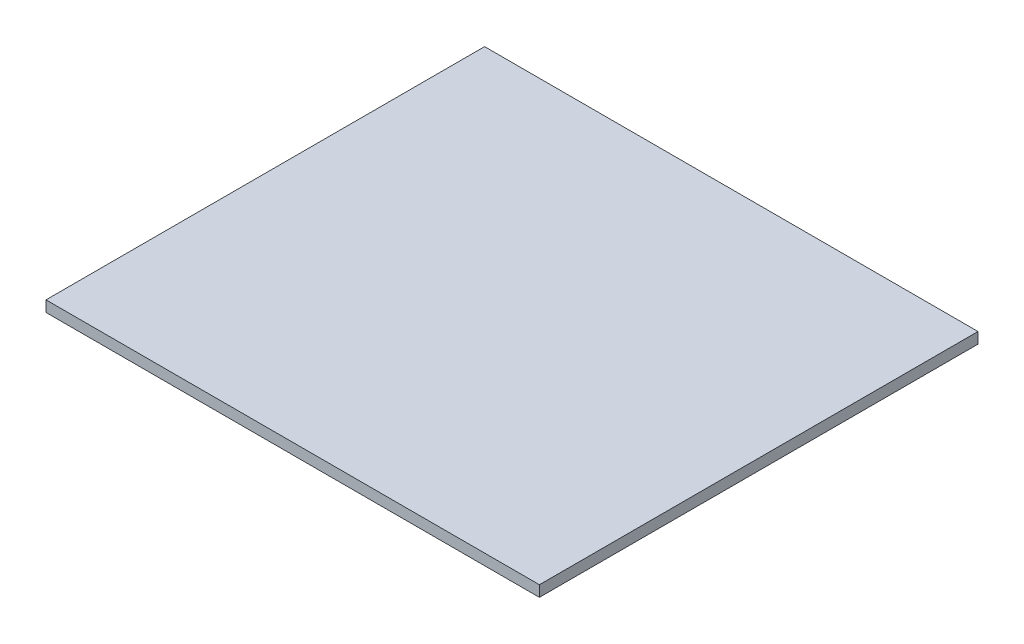
ISO-10303-21;
HEADER;
FILE_DESCRIPTION(('STEP AP214'),'2;1');
FILE_NAME('part.step','',(''),(''),'','','');
FILE_SCHEMA(('AUTOMOTIVE_DESIGN { 1 0 10303 214 1 1 1 1 }'));
ENDSEC;
DATA;
#1=APPLICATION_CONTEXT('core data for automotive mechanical design processes');
#2=APPLICATION_PROTOCOL_DEFINITION('international standard','automotive_design',2000,#1);
#3=PRODUCT_CONTEXT('',#1,'mechanical');
#4=PRODUCT('Part','Part','',(#3));
#5=PRODUCT_RELATED_PRODUCT_CATEGORY('part','',(#4));
#6=PRODUCT_DEFINITION_FORMATION('','',#4);
#7=PRODUCT_DEFINITION_CONTEXT('part definition',#1,'design');
#8=PRODUCT_DEFINITION('design','',#6,#7);
#9=PRODUCT_DEFINITION_SHAPE('','',#8);
#10=(LENGTH_UNIT() NAMED_UNIT(*) SI_UNIT(.MILLI.,.METRE.));
#11=(NAMED_UNIT(*) PLANE_ANGLE_UNIT() SI_UNIT($,.RADIAN.));
#12=(NAMED_UNIT(*) SI_UNIT($,.STERADIAN.) SOLID_ANGLE_UNIT());
#13=UNCERTAINTY_MEASURE_WITH_UNIT(LENGTH_MEASURE(1.E-05),#10,'distance_accuracy_value','');
#14=(GEOMETRIC_REPRESENTATION_CONTEXT(3) GLOBAL_UNCERTAINTY_ASSIGNED_CONTEXT((#13)) GLOBAL_UNIT_ASSIGNED_CONTEXT((#10,
#11,#12)) REPRESENTATION_CONTEXT('',''));
#15=CARTESIAN_POINT('',(0.,0.,0.));
#16=DIRECTION('',(0.,0.,1.));
#17=DIRECTION('',(1.,0.,0.));
#18=AXIS2_PLACEMENT_3D('',#15,#16,#17);
#19=CARTESIAN_POINT('',(-60.6345418134321,5.08,-38.1382480391732));
#20=DIRECTION('',(1.,0.,0.));
#21=DIRECTION('',(0.,0.,-1.));
#22=AXIS2_PLACEMENT_3D('',#19,#20,#21);
#23=PLANE('',#22);
#24=DIRECTION('',(0.,0.,1.));
#25=VECTOR('',#24,1.);
#26=CARTESIAN_POINT('',(-60.6345418134321,0.,-38.1382480391732));
#27=LINE('',#26,#25);
#28=CARTESIAN_POINT('',(-60.6345418134321,0.,-38.1382480391732));
#29=VERTEX_POINT('',#28);
#30=CARTESIAN_POINT('',(-60.634541813432,0.,165.061751960827));
#31=VERTEX_POINT('',#30);
#32=EDGE_CURVE('E107',#29,#31,#27,.T.);
#33=ORIENTED_EDGE('',*,*,#32,.T.);
#34=DIRECTION('',(0.,-1.,0.));
#35=VECTOR('',#34,1.);
#36=CARTESIAN_POINT('',(-60.634541813432,5.08,165.061751960827));
#37=LINE('',#36,#35);
#38=CARTESIAN_POINT('',(-60.634541813432,5.08,165.061751960827));
#39=VERTEX_POINT('',#38);
#40=EDGE_CURVE('E11',#39,#31,#37,.T.);
#41=ORIENTED_EDGE('',*,*,#40,.F.);
#42=DIRECTION('',(0.,0.,1.));
#43=VECTOR('',#42,1.);
#44=CARTESIAN_POINT('',(-60.6345418134321,5.08,-38.1382480391732));
#45=LINE('',#44,#43);
#46=CARTESIAN_POINT('',(-60.6345418134321,5.08,-38.1382480391732));
#47=VERTEX_POINT('',#46);
#48=EDGE_CURVE('E91',#47,#39,#45,.T.);
#49=ORIENTED_EDGE('',*,*,#48,.F.);
#50=DIRECTION('',(0.,-1.,0.));
#51=VECTOR('',#50,1.);
#52=CARTESIAN_POINT('',(-60.6345418134321,5.08,-38.1382480391732));
#53=LINE('',#52,#51);
#54=EDGE_CURVE('E103',#47,#29,#53,.T.);
#55=ORIENTED_EDGE('',*,*,#54,.T.);
#56=EDGE_LOOP('',(#33,#41,#49,#55));
#57=FACE_BOUND('',#56,.T.);
#58=ADVANCED_FACE('F39',(#57),#23,.F.);
#59=CARTESIAN_POINT('',(-60.634541813432,5.08,165.061751960827));
#60=DIRECTION('',(0.,0.,-1.));
#61=DIRECTION('',(-1.,0.,0.));
#62=AXIS2_PLACEMENT_3D('',#59,#60,#61);
#63=PLANE('',#62);
#64=DIRECTION('',(1.,0.,0.));
#65=VECTOR('',#64,1.);
#66=CARTESIAN_POINT('',(-60.634541813432,0.,165.061751960827));
#67=LINE('',#66,#65);
#68=CARTESIAN_POINT('',(167.965458186568,0.,165.061751960827));
#69=VERTEX_POINT('',#68);
#70=EDGE_CURVE('E96',#31,#69,#67,.T.);
#71=ORIENTED_EDGE('',*,*,#70,.T.);
#72=DIRECTION('',(0.,-1.,0.));
#73=VECTOR('',#72,1.);
#74=CARTESIAN_POINT('',(167.965458186568,5.08,165.061751960827));
#75=LINE('',#74,#73);
#76=CARTESIAN_POINT('',(167.965458186568,5.08,165.061751960827));
#77=VERTEX_POINT('',#76);
#78=EDGE_CURVE('E48',#77,#69,#75,.T.);
#79=ORIENTED_EDGE('',*,*,#78,.F.);
#80=DIRECTION('',(1.,0.,0.));
#81=VECTOR('',#80,1.);
#82=CARTESIAN_POINT('',(-60.634541813432,5.08,165.061751960827));
#83=LINE('',#82,#81);
#84=EDGE_CURVE('E86',#39,#77,#83,.T.);
#85=ORIENTED_EDGE('',*,*,#84,.F.);
#86=ORIENTED_EDGE('',*,*,#40,.T.);
#87=EDGE_LOOP('',(#71,#79,#85,#86));
#88=FACE_BOUND('',#87,.T.);
#89=ADVANCED_FACE('F95',(#88),#63,.F.);
#90=CARTESIAN_POINT('',(167.965458186568,5.08,-38.1382480391732));
#91=DIRECTION('',(-1.,0.,0.));
#92=DIRECTION('',(0.,0.,1.));
#93=AXIS2_PLACEMENT_3D('',#90,#91,#92);
#94=PLANE('',#93);
#95=DIRECTION('',(0.,0.,-1.));
#96=VECTOR('',#95,1.);
#97=CARTESIAN_POINT('',(167.965458186568,0.,-38.1382480391732));
#98=LINE('',#97,#96);
#99=CARTESIAN_POINT('',(167.965458186568,0.,-38.1382480391732));
#100=VERTEX_POINT('',#99);
#101=EDGE_CURVE('E73',#69,#100,#98,.T.);
#102=ORIENTED_EDGE('',*,*,#101,.T.);
#103=DIRECTION('',(0.,-1.,0.));
#104=VECTOR('',#103,1.);
#105=CARTESIAN_POINT('',(167.965458186568,5.08,-38.1382480391732));
#106=LINE('',#105,#104);
#107=CARTESIAN_POINT('',(167.965458186568,5.08,-38.1382480391732));
#108=VERTEX_POINT('',#107);
#109=EDGE_CURVE('E98',#108,#100,#106,.T.);
#110=ORIENTED_EDGE('',*,*,#109,.F.);
#111=DIRECTION('',(0.,0.,-1.));
#112=VECTOR('',#111,1.);
#113=CARTESIAN_POINT('',(167.965458186568,5.08,-38.1382480391732));
#114=LINE('',#113,#112);
#115=EDGE_CURVE('E89',#77,#108,#114,.T.);
#116=ORIENTED_EDGE('',*,*,#115,.F.);
#117=ORIENTED_EDGE('',*,*,#78,.T.);
#118=EDGE_LOOP('',(#102,#110,#116,#117));
#119=FACE_BOUND('',#118,.T.);
#120=ADVANCED_FACE('F99',(#119),#94,.F.);
#121=CARTESIAN_POINT('',(-60.6345418134321,5.08,-38.1382480391732));
#122=DIRECTION('',(0.,0.,1.));
#123=DIRECTION('',(1.,0.,0.));
#124=AXIS2_PLACEMENT_3D('',#121,#122,#123);
#125=PLANE('',#124);
#126=DIRECTION('',(-1.,0.,0.));
#127=VECTOR('',#126,1.);
#128=CARTESIAN_POINT('',(-60.6345418134321,0.,-38.1382480391732));
#129=LINE('',#128,#127);
#130=EDGE_CURVE('E79',#100,#29,#129,.T.);
#131=ORIENTED_EDGE('',*,*,#130,.T.);
#132=ORIENTED_EDGE('',*,*,#54,.F.);
#133=DIRECTION('',(-1.,0.,0.));
#134=VECTOR('',#133,1.);
#135=CARTESIAN_POINT('',(-60.6345418134321,5.08,-38.1382480391732));
#136=LINE('',#135,#134);
#137=EDGE_CURVE('E56',#108,#47,#136,.T.);
#138=ORIENTED_EDGE('',*,*,#137,.F.);
#139=ORIENTED_EDGE('',*,*,#109,.T.);
#140=EDGE_LOOP('',(#131,#132,#138,#139));
#141=FACE_BOUND('',#140,.T.);
#142=ADVANCED_FACE('F120',(#141),#125,.F.);
#143=CARTESIAN_POINT('',(0.,5.08,0.));
#144=DIRECTION('',(0.,1.,0.));
#145=DIRECTION('',(0.,0.,1.));
#146=AXIS2_PLACEMENT_3D('',#143,#144,#145);
#147=PLANE('',#146);
#148=ORIENTED_EDGE('',*,*,#48,.T.);
#149=ORIENTED_EDGE('',*,*,#84,.T.);
#150=ORIENTED_EDGE('',*,*,#115,.T.);
#151=ORIENTED_EDGE('',*,*,#137,.T.);
#152=EDGE_LOOP('',(#148,#149,#150,#151));
#153=FACE_BOUND('',#152,.T.);
#154=ADVANCED_FACE('F87',(#153),#147,.T.);
#155=CARTESIAN_POINT('',(0.,0.,0.));
#156=DIRECTION('',(0.,1.,0.));
#157=DIRECTION('',(0.,0.,1.));
#158=AXIS2_PLACEMENT_3D('',#155,#156,#157);
#159=PLANE('',#158);
#160=ORIENTED_EDGE('',*,*,#32,.F.);
#161=ORIENTED_EDGE('',*,*,#130,.F.);
#162=ORIENTED_EDGE('',*,*,#101,.F.);
#163=ORIENTED_EDGE('',*,*,#70,.F.);
#164=EDGE_LOOP('',(#160,#161,#162,#163));
#165=FACE_BOUND('',#164,.T.);
#166=ADVANCED_FACE('F123',(#165),#159,.F.);
#167=CLOSED_SHELL('',(#58,#89,#120,#142,#154,#166));
#168=MANIFOLD_SOLID_BREP('B2',#167);
#169=ADVANCED_BREP_SHAPE_REPRESENTATION('',(#18,#168),#14);
#170=SHAPE_DEFINITION_REPRESENTATION(#9,#169);
ENDSEC;
END-ISO-10303-21;
